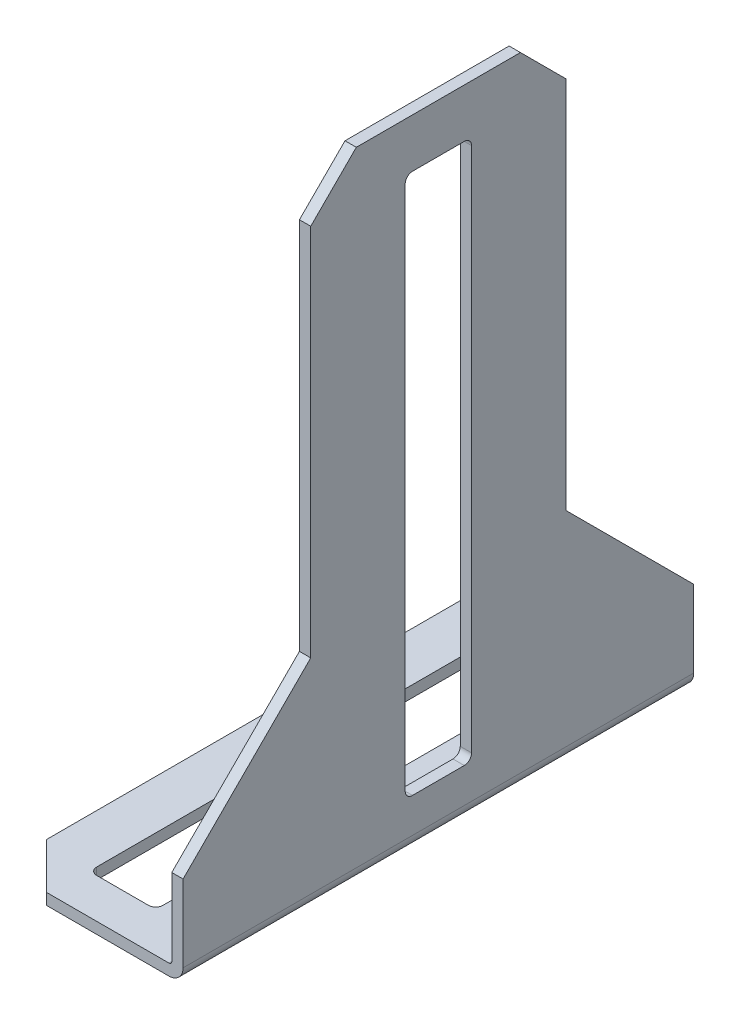
ISO-10303-21;
HEADER;
FILE_DESCRIPTION(('STEP AP214'),'2;1');
FILE_NAME('part.step','',(''),(''),'','','');
FILE_SCHEMA(('AUTOMOTIVE_DESIGN { 1 0 10303 214 1 1 1 1 }'));
ENDSEC;
DATA;
#1=APPLICATION_CONTEXT('core data for automotive mechanical design processes');
#2=APPLICATION_PROTOCOL_DEFINITION('international standard','automotive_design',2000,#1);
#3=PRODUCT_CONTEXT('',#1,'mechanical');
#4=PRODUCT('Part','Part','',(#3));
#5=PRODUCT_RELATED_PRODUCT_CATEGORY('part','',(#4));
#6=PRODUCT_DEFINITION_FORMATION('','',#4);
#7=PRODUCT_DEFINITION_CONTEXT('part definition',#1,'design');
#8=PRODUCT_DEFINITION('design','',#6,#7);
#9=PRODUCT_DEFINITION_SHAPE('','',#8);
#10=(LENGTH_UNIT() NAMED_UNIT(*) SI_UNIT(.MILLI.,.METRE.));
#11=(NAMED_UNIT(*) PLANE_ANGLE_UNIT() SI_UNIT($,.RADIAN.));
#12=(NAMED_UNIT(*) SI_UNIT($,.STERADIAN.) SOLID_ANGLE_UNIT());
#13=UNCERTAINTY_MEASURE_WITH_UNIT(LENGTH_MEASURE(1.E-05),#10,'distance_accuracy_value','');
#14=(GEOMETRIC_REPRESENTATION_CONTEXT(3) GLOBAL_UNCERTAINTY_ASSIGNED_CONTEXT((#13)) GLOBAL_UNIT_ASSIGNED_CONTEXT((#10,
#11,#12)) REPRESENTATION_CONTEXT('',''));
#15=CARTESIAN_POINT('',(0.,0.,0.));
#16=DIRECTION('',(0.,0.,1.));
#17=DIRECTION('',(1.,0.,0.));
#18=AXIS2_PLACEMENT_3D('',#15,#16,#17);
#19=CARTESIAN_POINT('',(3.9116,0.878660632863688,-14.5034));
#20=DIRECTION('',(0.,-1.,0.));
#21=DIRECTION('',(0.,0.,-1.));
#22=AXIS2_PLACEMENT_3D('',#19,#20,#21);
#23=CYLINDRICAL_SURFACE('',#22,0.508);
#24=CARTESIAN_POINT('',(3.9116,0.7874,-14.5034));
#25=DIRECTION('',(0.,-1.,0.));
#26=DIRECTION('',(0.,0.,-1.));
#27=AXIS2_PLACEMENT_3D('',#24,#25,#26);
#28=CIRCLE('',#27,0.508);
#29=CARTESIAN_POINT('',(3.4036,0.7874,-14.5034));
#30=VERTEX_POINT('',#29);
#31=CARTESIAN_POINT('',(3.9116,0.7874,-15.0114));
#32=VERTEX_POINT('',#31);
#33=EDGE_CURVE('E456',#30,#32,#28,.T.);
#34=ORIENTED_EDGE('',*,*,#33,.F.);
#35=DIRECTION('',(0.,1.,0.));
#36=VECTOR('',#35,1.);
#37=CARTESIAN_POINT('',(3.4036,0.7874,-14.5034));
#38=LINE('',#37,#36);
#39=CARTESIAN_POINT('',(3.4036,0.,-14.5034));
#40=VERTEX_POINT('',#39);
#41=EDGE_CURVE('E412',#30,#40,#38,.F.);
#42=ORIENTED_EDGE('',*,*,#41,.T.);
#43=CARTESIAN_POINT('',(3.9116,0.,-14.5034));
#44=DIRECTION('',(0.,-1.,0.));
#45=DIRECTION('',(0.,0.,-1.));
#46=AXIS2_PLACEMENT_3D('',#43,#44,#45);
#47=CIRCLE('',#46,0.508);
#48=CARTESIAN_POINT('',(3.9116,0.,-15.0114));
#49=VERTEX_POINT('',#48);
#50=EDGE_CURVE('E368',#49,#40,#47,.F.);
#51=ORIENTED_EDGE('',*,*,#50,.F.);
#52=DIRECTION('',(0.,1.,0.));
#53=VECTOR('',#52,1.);
#54=CARTESIAN_POINT('',(3.9116,0.7874,-15.0114));
#55=LINE('',#54,#53);
#56=EDGE_CURVE('E398',#49,#32,#55,.T.);
#57=ORIENTED_EDGE('',*,*,#56,.T.);
#58=EDGE_LOOP('',(#34,#42,#51,#57));
#59=FACE_BOUND('',#58,.T.);
#60=ADVANCED_FACE('F14',(#59),#23,.F.);
#61=CARTESIAN_POINT('',(3.4036,0.7874,-15.0114));
#62=DIRECTION('',(-1.,0.,0.));
#63=DIRECTION('',(0.,0.,1.));
#64=AXIS2_PLACEMENT_3D('',#61,#62,#63);
#65=PLANE('',#64);
#66=DIRECTION('',(0.,0.,-1.));
#67=VECTOR('',#66,1.);
#68=CARTESIAN_POINT('',(3.4036,0.,-17.78));
#69=LINE('',#68,#67);
#70=CARTESIAN_POINT('',(3.4036,0.,14.5034));
#71=VERTEX_POINT('',#70);
#72=EDGE_CURVE('E254',#40,#71,#69,.F.);
#73=ORIENTED_EDGE('',*,*,#72,.F.);
#74=ORIENTED_EDGE('',*,*,#41,.F.);
#75=DIRECTION('',(0.,0.,1.));
#76=VECTOR('',#75,1.);
#77=CARTESIAN_POINT('',(3.4036,0.7874,-17.78));
#78=LINE('',#77,#76);
#79=CARTESIAN_POINT('',(3.4036,0.7874,14.5034));
#80=VERTEX_POINT('',#79);
#81=EDGE_CURVE('E377',#80,#30,#78,.F.);
#82=ORIENTED_EDGE('',*,*,#81,.F.);
#83=DIRECTION('',(0.,-1.,0.));
#84=VECTOR('',#83,1.);
#85=CARTESIAN_POINT('',(3.4036,0.878660632863688,14.5034));
#86=LINE('',#85,#84);
#87=EDGE_CURVE('E410',#80,#71,#86,.T.);
#88=ORIENTED_EDGE('',*,*,#87,.T.);
#89=EDGE_LOOP('',(#73,#74,#82,#88));
#90=FACE_BOUND('',#89,.T.);
#91=ADVANCED_FACE('F605',(#90),#65,.F.);
#92=CARTESIAN_POINT('',(3.9116,0.878660632863688,14.5034));
#93=DIRECTION('',(0.,-1.,0.));
#94=DIRECTION('',(0.,0.,-1.));
#95=AXIS2_PLACEMENT_3D('',#92,#93,#94);
#96=CYLINDRICAL_SURFACE('',#95,0.508);
#97=CARTESIAN_POINT('',(3.9116,0.7874,14.5034));
#98=DIRECTION('',(0.,-1.,0.));
#99=DIRECTION('',(0.,0.,-1.));
#100=AXIS2_PLACEMENT_3D('',#97,#98,#99);
#101=CIRCLE('',#100,0.508);
#102=CARTESIAN_POINT('',(3.9116,0.7874,15.0114));
#103=VERTEX_POINT('',#102);
#104=EDGE_CURVE('E444',#103,#80,#101,.T.);
#105=ORIENTED_EDGE('',*,*,#104,.F.);
#106=DIRECTION('',(0.,1.,0.));
#107=VECTOR('',#106,1.);
#108=CARTESIAN_POINT('',(3.9116,0.7874,15.0114));
#109=LINE('',#108,#107);
#110=CARTESIAN_POINT('',(3.9116,0.,15.0114));
#111=VERTEX_POINT('',#110);
#112=EDGE_CURVE('E408',#103,#111,#109,.F.);
#113=ORIENTED_EDGE('',*,*,#112,.T.);
#114=CARTESIAN_POINT('',(3.9116,0.,14.5034));
#115=DIRECTION('',(0.,-1.,0.));
#116=DIRECTION('',(0.,0.,-1.));
#117=AXIS2_PLACEMENT_3D('',#114,#115,#116);
#118=CIRCLE('',#117,0.508);
#119=EDGE_CURVE('E439',#71,#111,#118,.F.);
#120=ORIENTED_EDGE('',*,*,#119,.F.);
#121=ORIENTED_EDGE('',*,*,#87,.F.);
#122=EDGE_LOOP('',(#105,#113,#120,#121));
#123=FACE_BOUND('',#122,.T.);
#124=ADVANCED_FACE('F601',(#123),#96,.F.);
#125=CARTESIAN_POINT('',(3.4036,0.7874,15.0114));
#126=DIRECTION('',(0.,0.,1.));
#127=DIRECTION('',(1.,0.,0.));
#128=AXIS2_PLACEMENT_3D('',#125,#126,#127);
#129=PLANE('',#128);
#130=DIRECTION('',(1.,0.,0.));
#131=VECTOR('',#130,1.);
#132=CARTESIAN_POINT('',(0.,0.,15.0114));
#133=LINE('',#132,#131);
#134=CARTESIAN_POINT('',(7.5184,0.,15.0114));
#135=VERTEX_POINT('',#134);
#136=EDGE_CURVE('E438',#111,#135,#133,.T.);
#137=ORIENTED_EDGE('',*,*,#136,.F.);
#138=ORIENTED_EDGE('',*,*,#112,.F.);
#139=DIRECTION('',(1.,0.,0.));
#140=VECTOR('',#139,1.);
#141=CARTESIAN_POINT('',(11.9126,0.7874,15.0114));
#142=LINE('',#141,#140);
#143=CARTESIAN_POINT('',(7.5184,0.7874,15.0114));
#144=VERTEX_POINT('',#143);
#145=EDGE_CURVE('E447',#144,#103,#142,.F.);
#146=ORIENTED_EDGE('',*,*,#145,.F.);
#147=DIRECTION('',(0.,-1.,0.));
#148=VECTOR('',#147,1.);
#149=CARTESIAN_POINT('',(7.5184,0.878660632863688,15.0114));
#150=LINE('',#149,#148);
#151=EDGE_CURVE('E406',#144,#135,#150,.T.);
#152=ORIENTED_EDGE('',*,*,#151,.T.);
#153=EDGE_LOOP('',(#137,#138,#146,#152));
#154=FACE_BOUND('',#153,.T.);
#155=ADVANCED_FACE('F597',(#154),#129,.F.);
#156=CARTESIAN_POINT('',(7.5184,0.878660632863688,14.5034));
#157=DIRECTION('',(0.,-1.,0.));
#158=DIRECTION('',(0.,0.,-1.));
#159=AXIS2_PLACEMENT_3D('',#156,#157,#158);
#160=CYLINDRICAL_SURFACE('',#159,0.508);
#161=CARTESIAN_POINT('',(7.5184,0.7874,14.5034));
#162=DIRECTION('',(0.,-1.,0.));
#163=DIRECTION('',(0.,0.,-1.));
#164=AXIS2_PLACEMENT_3D('',#161,#162,#163);
#165=CIRCLE('',#164,0.508);
#166=CARTESIAN_POINT('',(8.0264,0.7874,14.5034));
#167=VERTEX_POINT('',#166);
#168=EDGE_CURVE('E448',#167,#144,#165,.T.);
#169=ORIENTED_EDGE('',*,*,#168,.F.);
#170=DIRECTION('',(0.,1.,0.));
#171=VECTOR('',#170,1.);
#172=CARTESIAN_POINT('',(8.0264,0.7874,14.5034));
#173=LINE('',#172,#171);
#174=CARTESIAN_POINT('',(8.0264,0.,14.5034));
#175=VERTEX_POINT('',#174);
#176=EDGE_CURVE('E404',#167,#175,#173,.F.);
#177=ORIENTED_EDGE('',*,*,#176,.T.);
#178=CARTESIAN_POINT('',(7.5184,0.,14.5034));
#179=DIRECTION('',(0.,-1.,0.));
#180=DIRECTION('',(0.,0.,-1.));
#181=AXIS2_PLACEMENT_3D('',#178,#179,#180);
#182=CIRCLE('',#181,0.508);
#183=EDGE_CURVE('E435',#135,#175,#182,.F.);
#184=ORIENTED_EDGE('',*,*,#183,.F.);
#185=ORIENTED_EDGE('',*,*,#151,.F.);
#186=EDGE_LOOP('',(#169,#177,#184,#185));
#187=FACE_BOUND('',#186,.T.);
#188=ADVANCED_FACE('F593',(#187),#160,.F.);
#189=CARTESIAN_POINT('',(8.0264,0.7874,15.0114));
#190=DIRECTION('',(1.,0.,0.));
#191=DIRECTION('',(0.,0.,-1.));
#192=AXIS2_PLACEMENT_3D('',#189,#190,#191);
#193=PLANE('',#192);
#194=DIRECTION('',(0.,0.,1.));
#195=VECTOR('',#194,1.);
#196=CARTESIAN_POINT('',(8.0264,0.7874,-17.78));
#197=LINE('',#196,#195);
#198=CARTESIAN_POINT('',(8.0264,0.7874,-14.5034));
#199=VERTEX_POINT('',#198);
#200=EDGE_CURVE('E451',#199,#167,#197,.T.);
#201=ORIENTED_EDGE('',*,*,#200,.F.);
#202=DIRECTION('',(0.,-1.,0.));
#203=VECTOR('',#202,1.);
#204=CARTESIAN_POINT('',(8.0264,0.878660632863688,-14.5034));
#205=LINE('',#204,#203);
#206=CARTESIAN_POINT('',(8.0264,0.,-14.5034));
#207=VERTEX_POINT('',#206);
#208=EDGE_CURVE('E401',#199,#207,#205,.T.);
#209=ORIENTED_EDGE('',*,*,#208,.T.);
#210=DIRECTION('',(0.,0.,-1.));
#211=VECTOR('',#210,1.);
#212=CARTESIAN_POINT('',(8.0264,0.,-17.78));
#213=LINE('',#212,#211);
#214=EDGE_CURVE('E434',#175,#207,#213,.T.);
#215=ORIENTED_EDGE('',*,*,#214,.F.);
#216=ORIENTED_EDGE('',*,*,#176,.F.);
#217=EDGE_LOOP('',(#201,#209,#215,#216));
#218=FACE_BOUND('',#217,.T.);
#219=ADVANCED_FACE('F589',(#218),#193,.F.);
#220=CARTESIAN_POINT('',(7.5184,0.878660632863688,-14.5034));
#221=DIRECTION('',(0.,-1.,0.));
#222=DIRECTION('',(0.,0.,-1.));
#223=AXIS2_PLACEMENT_3D('',#220,#221,#222);
#224=CYLINDRICAL_SURFACE('',#223,0.508);
#225=CARTESIAN_POINT('',(7.5184,0.7874,-14.5034));
#226=DIRECTION('',(0.,-1.,0.));
#227=DIRECTION('',(0.,0.,-1.));
#228=AXIS2_PLACEMENT_3D('',#225,#226,#227);
#229=CIRCLE('',#228,0.508);
#230=CARTESIAN_POINT('',(7.5184,0.7874,-15.0114));
#231=VERTEX_POINT('',#230);
#232=EDGE_CURVE('E452',#231,#199,#229,.T.);
#233=ORIENTED_EDGE('',*,*,#232,.F.);
#234=DIRECTION('',(0.,1.,0.));
#235=VECTOR('',#234,1.);
#236=CARTESIAN_POINT('',(7.5184,0.7874,-15.0114));
#237=LINE('',#236,#235);
#238=CARTESIAN_POINT('',(7.5184,0.,-15.0114));
#239=VERTEX_POINT('',#238);
#240=EDGE_CURVE('E399',#231,#239,#237,.F.);
#241=ORIENTED_EDGE('',*,*,#240,.T.);
#242=CARTESIAN_POINT('',(7.5184,0.,-14.5034));
#243=DIRECTION('',(0.,-1.,0.));
#244=DIRECTION('',(0.,0.,-1.));
#245=AXIS2_PLACEMENT_3D('',#242,#243,#244);
#246=CIRCLE('',#245,0.508);
#247=EDGE_CURVE('E431',#207,#239,#246,.F.);
#248=ORIENTED_EDGE('',*,*,#247,.F.);
#249=ORIENTED_EDGE('',*,*,#208,.F.);
#250=EDGE_LOOP('',(#233,#241,#248,#249));
#251=FACE_BOUND('',#250,.T.);
#252=ADVANCED_FACE('F585',(#251),#224,.F.);
#253=CARTESIAN_POINT('',(8.0264,0.7874,-15.0114));
#254=DIRECTION('',(0.,0.,-1.));
#255=DIRECTION('',(-1.,0.,0.));
#256=AXIS2_PLACEMENT_3D('',#253,#254,#255);
#257=PLANE('',#256);
#258=DIRECTION('',(1.,0.,0.));
#259=VECTOR('',#258,1.);
#260=CARTESIAN_POINT('',(0.,0.,-15.0114));
#261=LINE('',#260,#259);
#262=EDGE_CURVE('E394',#239,#49,#261,.F.);
#263=ORIENTED_EDGE('',*,*,#262,.F.);
#264=ORIENTED_EDGE('',*,*,#240,.F.);
#265=DIRECTION('',(1.,0.,0.));
#266=VECTOR('',#265,1.);
#267=CARTESIAN_POINT('',(11.9126,0.7874,-15.0114));
#268=LINE('',#267,#266);
#269=EDGE_CURVE('E455',#32,#231,#268,.T.);
#270=ORIENTED_EDGE('',*,*,#269,.F.);
#271=ORIENTED_EDGE('',*,*,#56,.F.);
#272=EDGE_LOOP('',(#263,#264,#270,#271));
#273=FACE_BOUND('',#272,.T.);
#274=ADVANCED_FACE('F582',(#273),#257,.F.);
#275=CARTESIAN_POINT('',(0.,0.7874,-17.78));
#276=DIRECTION('',(-1.,0.,0.));
#277=DIRECTION('',(0.,0.,1.));
#278=AXIS2_PLACEMENT_3D('',#275,#276,#277);
#279=PLANE('',#278);
#280=DIRECTION('',(0.,0.,-1.));
#281=VECTOR('',#280,1.);
#282=CARTESIAN_POINT('',(0.,0.,-17.78));
#283=LINE('',#282,#281);
#284=CARTESIAN_POINT('',(0.,0.,14.605));
#285=VERTEX_POINT('',#284);
#286=CARTESIAN_POINT('',(0.,0.,-14.605));
#287=VERTEX_POINT('',#286);
#288=EDGE_CURVE('E373',#285,#287,#283,.T.);
#289=ORIENTED_EDGE('',*,*,#288,.F.);
#290=DIRECTION('',(0.,1.,0.));
#291=VECTOR('',#290,1.);
#292=CARTESIAN_POINT('',(0.,0.3937,14.605));
#293=LINE('',#292,#291);
#294=CARTESIAN_POINT('',(0.,0.7874,14.605));
#295=VERTEX_POINT('',#294);
#296=EDGE_CURVE('E388',#295,#285,#293,.F.);
#297=ORIENTED_EDGE('',*,*,#296,.F.);
#298=DIRECTION('',(0.,0.,1.));
#299=VECTOR('',#298,1.);
#300=CARTESIAN_POINT('',(0.,0.7874,-17.78));
#301=LINE('',#300,#299);
#302=CARTESIAN_POINT('',(0.,0.7874,-14.605));
#303=VERTEX_POINT('',#302);
#304=EDGE_CURVE('E369',#303,#295,#301,.T.);
#305=ORIENTED_EDGE('',*,*,#304,.F.);
#306=DIRECTION('',(0.,1.,0.));
#307=VECTOR('',#306,1.);
#308=CARTESIAN_POINT('',(0.,0.3937,-14.605));
#309=LINE('',#308,#307);
#310=EDGE_CURVE('E396',#287,#303,#309,.T.);
#311=ORIENTED_EDGE('',*,*,#310,.F.);
#312=EDGE_LOOP('',(#289,#297,#305,#311));
#313=FACE_BOUND('',#312,.T.);
#314=ADVANCED_FACE('F469',(#313),#279,.T.);
#315=CARTESIAN_POINT('',(1.5875,0.3937,-16.1925));
#316=DIRECTION('',(-0.707106781186548,0.,-0.707106781186548));
#317=DIRECTION('',(-0.707106781186548,0.,0.707106781186548));
#318=AXIS2_PLACEMENT_3D('',#315,#316,#317);
#319=PLANE('',#318);
#320=DIRECTION('',(0.,1.,0.));
#321=VECTOR('',#320,1.);
#322=CARTESIAN_POINT('',(3.175,0.3937,-17.78));
#323=LINE('',#322,#321);
#324=CARTESIAN_POINT('',(3.175,0.7874,-17.78));
#325=VERTEX_POINT('',#324);
#326=CARTESIAN_POINT('',(3.175,0.,-17.78));
#327=VERTEX_POINT('',#326);
#328=EDGE_CURVE('E391',#325,#327,#323,.F.);
#329=ORIENTED_EDGE('',*,*,#328,.T.);
#330=DIRECTION('',(0.707106781186547,0.,-0.707106781186548));
#331=VECTOR('',#330,1.);
#332=CARTESIAN_POINT('',(0.,0.,-14.605));
#333=LINE('',#332,#331);
#334=EDGE_CURVE('E362',#287,#327,#333,.T.);
#335=ORIENTED_EDGE('',*,*,#334,.F.);
#336=ORIENTED_EDGE('',*,*,#310,.T.);
#337=DIRECTION('',(-0.707106781186547,0.,0.707106781186548));
#338=VECTOR('',#337,1.);
#339=CARTESIAN_POINT('',(3.175,0.7874,-17.78));
#340=LINE('',#339,#338);
#341=EDGE_CURVE('E374',#325,#303,#340,.T.);
#342=ORIENTED_EDGE('',*,*,#341,.F.);
#343=EDGE_LOOP('',(#329,#335,#336,#342));
#344=FACE_BOUND('',#343,.T.);
#345=ADVANCED_FACE('F473',(#344),#319,.T.);
#346=CARTESIAN_POINT('',(1.5875,0.3937,16.1925));
#347=DIRECTION('',(-0.707106781186548,0.,0.707106781186548));
#348=DIRECTION('',(0.707106781186548,0.,0.707106781186548));
#349=AXIS2_PLACEMENT_3D('',#346,#347,#348);
#350=PLANE('',#349);
#351=DIRECTION('',(0.,1.,0.));
#352=VECTOR('',#351,1.);
#353=CARTESIAN_POINT('',(3.175,0.3937,17.78));
#354=LINE('',#353,#352);
#355=CARTESIAN_POINT('',(3.175,0.,17.78));
#356=VERTEX_POINT('',#355);
#357=CARTESIAN_POINT('',(3.175,0.7874,17.78));
#358=VERTEX_POINT('',#357);
#359=EDGE_CURVE('E233',#356,#358,#354,.T.);
#360=ORIENTED_EDGE('',*,*,#359,.T.);
#361=DIRECTION('',(0.707106781186549,0.,0.707106781186546));
#362=VECTOR('',#361,1.);
#363=CARTESIAN_POINT('',(0.,0.7874,14.605));
#364=LINE('',#363,#362);
#365=EDGE_CURVE('E365',#295,#358,#364,.T.);
#366=ORIENTED_EDGE('',*,*,#365,.F.);
#367=ORIENTED_EDGE('',*,*,#296,.T.);
#368=DIRECTION('',(-0.707106781186548,0.,-0.707106781186547));
#369=VECTOR('',#368,1.);
#370=CARTESIAN_POINT('',(3.175,0.,17.78));
#371=LINE('',#370,#369);
#372=EDGE_CURVE('E241',#356,#285,#371,.T.);
#373=ORIENTED_EDGE('',*,*,#372,.F.);
#374=EDGE_LOOP('',(#360,#366,#367,#373));
#375=FACE_BOUND('',#374,.T.);
#376=ADVANCED_FACE('F466',(#375),#350,.T.);
#377=CARTESIAN_POINT('',(11.7094,0.9906,17.8712606328632));
#378=DIRECTION('',(0.,0.,-1.));
#379=DIRECTION('',(-1.,0.,0.));
#380=AXIS2_PLACEMENT_3D('',#377,#378,#379);
#381=CYLINDRICAL_SURFACE('',#380,0.990599999999999);
#382=DIRECTION('',(0.,0.,-1.));
#383=VECTOR('',#382,1.);
#384=CARTESIAN_POINT('',(12.7,0.9906,-17.78));
#385=LINE('',#384,#383);
#386=CARTESIAN_POINT('',(12.7,0.9906,17.78));
#387=VERTEX_POINT('',#386);
#388=CARTESIAN_POINT('',(12.7,0.9906,-17.78));
#389=VERTEX_POINT('',#388);
#390=EDGE_CURVE('E227',#387,#389,#385,.T.);
#391=ORIENTED_EDGE('',*,*,#390,.F.);
#392=CARTESIAN_POINT('',(11.7094,0.9906,17.78));
#393=DIRECTION('',(0.,0.,-1.));
#394=DIRECTION('',(-1.,0.,0.));
#395=AXIS2_PLACEMENT_3D('',#392,#393,#394);
#396=CIRCLE('',#395,0.990599999999999);
#397=CARTESIAN_POINT('',(11.7094,0.,17.78));
#398=VERTEX_POINT('',#397);
#399=EDGE_CURVE('E232',#387,#398,#396,.T.);
#400=ORIENTED_EDGE('',*,*,#399,.T.);
#401=DIRECTION('',(0.,0.,-1.));
#402=VECTOR('',#401,1.);
#403=CARTESIAN_POINT('',(11.7094,0.,-17.78));
#404=LINE('',#403,#402);
#405=CARTESIAN_POINT('',(11.7094,0.,-17.78));
#406=VERTEX_POINT('',#405);
#407=EDGE_CURVE('E230',#406,#398,#404,.F.);
#408=ORIENTED_EDGE('',*,*,#407,.F.);
#409=CARTESIAN_POINT('',(11.7094,0.9906,-17.78));
#410=DIRECTION('',(0.,0.,-1.));
#411=DIRECTION('',(-1.,0.,0.));
#412=AXIS2_PLACEMENT_3D('',#409,#410,#411);
#413=CIRCLE('',#412,0.990599999999999);
#414=EDGE_CURVE('E18',#406,#389,#413,.F.);
#415=ORIENTED_EDGE('',*,*,#414,.T.);
#416=EDGE_LOOP('',(#391,#400,#408,#415));
#417=FACE_BOUND('',#416,.T.);
#418=ADVANCED_FACE('F226',(#417),#381,.T.);
#419=CARTESIAN_POINT('',(11.9126,0.7874,-17.78));
#420=DIRECTION('',(0.,1.,0.));
#421=DIRECTION('',(0.,0.,1.));
#422=AXIS2_PLACEMENT_3D('',#419,#420,#421);
#423=PLANE('',#422);
#424=DIRECTION('',(1.,0.,0.));
#425=VECTOR('',#424,1.);
#426=CARTESIAN_POINT('',(0.,0.7874,17.78));
#427=LINE('',#426,#425);
#428=CARTESIAN_POINT('',(11.7094,0.7874,17.78));
#429=VERTEX_POINT('',#428);
#430=EDGE_CURVE('E265',#429,#358,#427,.F.);
#431=ORIENTED_EDGE('',*,*,#430,.F.);
#432=DIRECTION('',(0.,0.,1.));
#433=VECTOR('',#432,1.);
#434=CARTESIAN_POINT('',(11.7094,0.787399999999999,-17.8579774517918));
#435=LINE('',#434,#433);
#436=CARTESIAN_POINT('',(11.7094,0.7874,-17.78));
#437=VERTEX_POINT('',#436);
#438=EDGE_CURVE('E249',#429,#437,#435,.F.);
#439=ORIENTED_EDGE('',*,*,#438,.T.);
#440=DIRECTION('',(1.,0.,0.));
#441=VECTOR('',#440,1.);
#442=CARTESIAN_POINT('',(0.,0.7874,-17.78));
#443=LINE('',#442,#441);
#444=EDGE_CURVE('E251',#437,#325,#443,.F.);
#445=ORIENTED_EDGE('',*,*,#444,.T.);
#446=ORIENTED_EDGE('',*,*,#341,.T.);
#447=ORIENTED_EDGE('',*,*,#304,.T.);
#448=ORIENTED_EDGE('',*,*,#365,.T.);
#449=EDGE_LOOP('',(#431,#439,#445,#446,#447,#448));
#450=FACE_BOUND('',#449,.T.);
#451=ORIENTED_EDGE('',*,*,#104,.T.);
#452=ORIENTED_EDGE('',*,*,#81,.T.);
#453=ORIENTED_EDGE('',*,*,#33,.T.);
#454=ORIENTED_EDGE('',*,*,#269,.T.);
#455=ORIENTED_EDGE('',*,*,#232,.T.);
#456=ORIENTED_EDGE('',*,*,#200,.T.);
#457=ORIENTED_EDGE('',*,*,#168,.T.);
#458=ORIENTED_EDGE('',*,*,#145,.T.);
#459=EDGE_LOOP('',(#451,#452,#453,#454,#455,#456,#457,#458));
#460=FACE_BOUND('',#459,.T.);
#461=ADVANCED_FACE('F571',(#450,#460),#423,.T.);
#462=CARTESIAN_POINT('',(0.,0.,-17.78));
#463=DIRECTION('',(0.,-1.,0.));
#464=DIRECTION('',(0.,0.,-1.));
#465=AXIS2_PLACEMENT_3D('',#462,#463,#464);
#466=PLANE('',#465);
#467=DIRECTION('',(1.,0.,0.));
#468=VECTOR('',#467,1.);
#469=CARTESIAN_POINT('',(0.,0.,17.78));
#470=LINE('',#469,#468);
#471=EDGE_CURVE('E262',#356,#398,#470,.T.);
#472=ORIENTED_EDGE('',*,*,#471,.F.);
#473=ORIENTED_EDGE('',*,*,#372,.T.);
#474=ORIENTED_EDGE('',*,*,#288,.T.);
#475=ORIENTED_EDGE('',*,*,#334,.T.);
#476=DIRECTION('',(1.,0.,0.));
#477=VECTOR('',#476,1.);
#478=CARTESIAN_POINT('',(0.,0.,-17.78));
#479=LINE('',#478,#477);
#480=EDGE_CURVE('E247',#327,#406,#479,.T.);
#481=ORIENTED_EDGE('',*,*,#480,.T.);
#482=ORIENTED_EDGE('',*,*,#407,.T.);
#483=EDGE_LOOP('',(#472,#473,#474,#475,#481,#482));
#484=FACE_BOUND('',#483,.T.);
#485=ORIENTED_EDGE('',*,*,#247,.T.);
#486=ORIENTED_EDGE('',*,*,#262,.T.);
#487=ORIENTED_EDGE('',*,*,#50,.T.);
#488=ORIENTED_EDGE('',*,*,#72,.T.);
#489=ORIENTED_EDGE('',*,*,#119,.T.);
#490=ORIENTED_EDGE('',*,*,#136,.T.);
#491=ORIENTED_EDGE('',*,*,#183,.T.);
#492=ORIENTED_EDGE('',*,*,#214,.T.);
#493=EDGE_LOOP('',(#485,#486,#487,#488,#489,#490,#491,#492));
#494=FACE_BOUND('',#493,.T.);
#495=ADVANCED_FACE('F460',(#484,#494),#466,.T.);
#496=CARTESIAN_POINT('',(12.7,0.,-17.78));
#497=DIRECTION('',(1.,0.,0.));
#498=DIRECTION('',(0.,0.,-1.));
#499=AXIS2_PLACEMENT_3D('',#496,#497,#498);
#500=PLANE('',#499);
#501=DIRECTION('',(0.,1.,0.));
#502=VECTOR('',#501,1.);
#503=CARTESIAN_POINT('',(12.7,44.45,-8.89));
#504=LINE('',#503,#502);
#505=CARTESIAN_POINT('',(12.7,15.24,-8.89));
#506=VERTEX_POINT('',#505);
#507=CARTESIAN_POINT('',(12.7,41.275,-8.89));
#508=VERTEX_POINT('',#507);
#509=EDGE_CURVE('E308',#506,#508,#504,.T.);
#510=ORIENTED_EDGE('',*,*,#509,.T.);
#511=DIRECTION('',(0.,0.707106781186548,0.707106781186548));
#512=VECTOR('',#511,1.);
#513=CARTESIAN_POINT('',(12.7,42.8625,-7.3025));
#514=LINE('',#513,#512);
#515=CARTESIAN_POINT('',(12.7,44.45,-5.715));
#516=VERTEX_POINT('',#515);
#517=EDGE_CURVE('E315',#516,#508,#514,.F.);
#518=ORIENTED_EDGE('',*,*,#517,.F.);
#519=DIRECTION('',(0.,0.,1.));
#520=VECTOR('',#519,1.);
#521=CARTESIAN_POINT('',(12.7,44.45,-17.78));
#522=LINE('',#521,#520);
#523=CARTESIAN_POINT('',(12.7,44.45,5.715));
#524=VERTEX_POINT('',#523);
#525=EDGE_CURVE('E316',#524,#516,#522,.F.);
#526=ORIENTED_EDGE('',*,*,#525,.F.);
#527=DIRECTION('',(0.,-0.707106781186548,0.707106781186548));
#528=VECTOR('',#527,1.);
#529=CARTESIAN_POINT('',(12.7,42.8625,7.3025));
#530=LINE('',#529,#528);
#531=CARTESIAN_POINT('',(12.7,41.275,8.89));
#532=VERTEX_POINT('',#531);
#533=EDGE_CURVE('E323',#532,#524,#530,.F.);
#534=ORIENTED_EDGE('',*,*,#533,.F.);
#535=DIRECTION('',(0.,1.,0.));
#536=VECTOR('',#535,1.);
#537=CARTESIAN_POINT('',(12.7,15.24,8.89));
#538=LINE('',#537,#536);
#539=CARTESIAN_POINT('',(12.7,15.24,8.89));
#540=VERTEX_POINT('',#539);
#541=EDGE_CURVE('E329',#532,#540,#538,.F.);
#542=ORIENTED_EDGE('',*,*,#541,.T.);
#543=DIRECTION('',(0.,0.707106781186548,-0.707106781186548));
#544=VECTOR('',#543,1.);
#545=CARTESIAN_POINT('',(12.7,6.35,17.78));
#546=LINE('',#545,#544);
#547=CARTESIAN_POINT('',(12.7,6.35,17.78));
#548=VERTEX_POINT('',#547);
#549=EDGE_CURVE('E294',#540,#548,#546,.F.);
#550=ORIENTED_EDGE('',*,*,#549,.T.);
#551=DIRECTION('',(0.,1.,0.));
#552=VECTOR('',#551,1.);
#553=CARTESIAN_POINT('',(12.7,0.,17.78));
#554=LINE('',#553,#552);
#555=EDGE_CURVE('E239',#387,#548,#554,.T.);
#556=ORIENTED_EDGE('',*,*,#555,.F.);
#557=ORIENTED_EDGE('',*,*,#390,.T.);
#558=DIRECTION('',(0.,1.,0.));
#559=VECTOR('',#558,1.);
#560=CARTESIAN_POINT('',(12.7,0.,-17.78));
#561=LINE('',#560,#559);
#562=CARTESIAN_POINT('',(12.7,6.35,-17.78));
#563=VERTEX_POINT('',#562);
#564=EDGE_CURVE('E237',#389,#563,#561,.T.);
#565=ORIENTED_EDGE('',*,*,#564,.T.);
#566=DIRECTION('',(0.,-0.707106781186548,-0.707106781186548));
#567=VECTOR('',#566,1.);
#568=CARTESIAN_POINT('',(12.7,15.24,-8.89));
#569=LINE('',#568,#567);
#570=EDGE_CURVE('E302',#563,#506,#569,.F.);
#571=ORIENTED_EDGE('',*,*,#570,.T.);
#572=EDGE_LOOP('',(#510,#518,#526,#534,#542,#550,#556,#557,#565,#571));
#573=FACE_BOUND('',#572,.T.);
#574=CARTESIAN_POINT('',(12.7,40.5384,-1.8034));
#575=DIRECTION('',(1.,0.,0.));
#576=DIRECTION('',(0.,0.,-1.));
#577=AXIS2_PLACEMENT_3D('',#574,#575,#576);
#578=CIRCLE('',#577,0.508);
#579=CARTESIAN_POINT('',(12.7,41.0464,-1.8034));
#580=VERTEX_POINT('',#579);
#581=CARTESIAN_POINT('',(12.7,40.5384,-2.3114));
#582=VERTEX_POINT('',#581);
#583=EDGE_CURVE('E354',#580,#582,#578,.F.);
#584=ORIENTED_EDGE('',*,*,#583,.T.);
#585=DIRECTION('',(0.,1.,0.));
#586=VECTOR('',#585,1.);
#587=CARTESIAN_POINT('',(12.7,41.0464,-2.3114));
#588=LINE('',#587,#586);
#589=CARTESIAN_POINT('',(12.7,3.9116,-2.3114));
#590=VERTEX_POINT('',#589);
#591=EDGE_CURVE('E357',#582,#590,#588,.F.);
#592=ORIENTED_EDGE('',*,*,#591,.T.);
#593=CARTESIAN_POINT('',(12.7,3.9116,-1.8034));
#594=DIRECTION('',(1.,0.,0.));
#595=DIRECTION('',(0.,0.,-1.));
#596=AXIS2_PLACEMENT_3D('',#593,#594,#595);
#597=CIRCLE('',#596,0.508);
#598=CARTESIAN_POINT('',(12.7,3.4036,-1.8034));
#599=VERTEX_POINT('',#598);
#600=EDGE_CURVE('E240',#590,#599,#597,.F.);
#601=ORIENTED_EDGE('',*,*,#600,.T.);
#602=DIRECTION('',(0.,0.,-1.));
#603=VECTOR('',#602,1.);
#604=CARTESIAN_POINT('',(12.7,3.4036,-2.3114));
#605=LINE('',#604,#603);
#606=CARTESIAN_POINT('',(12.7,3.4036,1.8034));
#607=VERTEX_POINT('',#606);
#608=EDGE_CURVE('E336',#599,#607,#605,.F.);
#609=ORIENTED_EDGE('',*,*,#608,.T.);
#610=CARTESIAN_POINT('',(12.7,3.9116,1.8034));
#611=DIRECTION('',(1.,0.,0.));
#612=DIRECTION('',(0.,0.,-1.));
#613=AXIS2_PLACEMENT_3D('',#610,#611,#612);
#614=CIRCLE('',#613,0.508);
#615=CARTESIAN_POINT('',(12.7,3.9116,2.3114));
#616=VERTEX_POINT('',#615);
#617=EDGE_CURVE('E342',#607,#616,#614,.F.);
#618=ORIENTED_EDGE('',*,*,#617,.T.);
#619=DIRECTION('',(0.,1.,0.));
#620=VECTOR('',#619,1.);
#621=CARTESIAN_POINT('',(12.7,3.4036,2.3114));
#622=LINE('',#621,#620);
#623=CARTESIAN_POINT('',(12.7,40.5384,2.3114));
#624=VERTEX_POINT('',#623);
#625=EDGE_CURVE('E345',#616,#624,#622,.T.);
#626=ORIENTED_EDGE('',*,*,#625,.T.);
#627=CARTESIAN_POINT('',(12.7,40.5384,1.8034));
#628=DIRECTION('',(1.,0.,0.));
#629=DIRECTION('',(0.,0.,-1.));
#630=AXIS2_PLACEMENT_3D('',#627,#628,#629);
#631=CIRCLE('',#630,0.508);
#632=CARTESIAN_POINT('',(12.7,41.0464,1.8034));
#633=VERTEX_POINT('',#632);
#634=EDGE_CURVE('E348',#624,#633,#631,.F.);
#635=ORIENTED_EDGE('',*,*,#634,.T.);
#636=DIRECTION('',(0.,0.,1.));
#637=VECTOR('',#636,1.);
#638=CARTESIAN_POINT('',(12.7,41.0464,2.3114));
#639=LINE('',#638,#637);
#640=EDGE_CURVE('E351',#633,#580,#639,.F.);
#641=ORIENTED_EDGE('',*,*,#640,.T.);
#642=EDGE_LOOP('',(#584,#592,#601,#609,#618,#626,#635,#641));
#643=FACE_BOUND('',#642,.T.);
#644=ADVANCED_FACE('F235',(#573,#643),#500,.T.);
#645=CARTESIAN_POINT('',(11.8213393671368,3.9116,-1.8034));
#646=DIRECTION('',(1.,0.,0.));
#647=DIRECTION('',(0.,0.,-1.));
#648=AXIS2_PLACEMENT_3D('',#645,#646,#647);
#649=CYLINDRICAL_SURFACE('',#648,0.508);
#650=CARTESIAN_POINT('',(11.9126,3.9116,-1.8034));
#651=DIRECTION('',(1.,0.,0.));
#652=DIRECTION('',(0.,0.,-1.));
#653=AXIS2_PLACEMENT_3D('',#650,#651,#652);
#654=CIRCLE('',#653,0.508);
#655=CARTESIAN_POINT('',(11.9126,3.4036,-1.8034));
#656=VERTEX_POINT('',#655);
#657=CARTESIAN_POINT('',(11.9126,3.9116,-2.3114));
#658=VERTEX_POINT('',#657);
#659=EDGE_CURVE('E285',#656,#658,#654,.T.);
#660=ORIENTED_EDGE('',*,*,#659,.F.);
#661=DIRECTION('',(1.,0.,0.));
#662=VECTOR('',#661,1.);
#663=CARTESIAN_POINT('',(11.9126,3.4036,-1.8034));
#664=LINE('',#663,#662);
#665=EDGE_CURVE('E337',#656,#599,#664,.T.);
#666=ORIENTED_EDGE('',*,*,#665,.T.);
#667=ORIENTED_EDGE('',*,*,#600,.F.);
#668=DIRECTION('',(-1.,0.,0.));
#669=VECTOR('',#668,1.);
#670=CARTESIAN_POINT('',(11.9126,3.9116,-2.3114));
#671=LINE('',#670,#669);
#672=EDGE_CURVE('E355',#590,#658,#671,.T.);
#673=ORIENTED_EDGE('',*,*,#672,.T.);
#674=EDGE_LOOP('',(#660,#666,#667,#673));
#675=FACE_BOUND('',#674,.T.);
#676=ADVANCED_FACE('F562',(#675),#649,.F.);
#677=CARTESIAN_POINT('',(11.9126,41.0464,-2.3114));
#678=DIRECTION('',(0.,0.,-1.));
#679=DIRECTION('',(-1.,0.,0.));
#680=AXIS2_PLACEMENT_3D('',#677,#678,#679);
#681=PLANE('',#680);
#682=ORIENTED_EDGE('',*,*,#591,.F.);
#683=DIRECTION('',(1.,0.,0.));
#684=VECTOR('',#683,1.);
#685=CARTESIAN_POINT('',(11.8213393671368,40.5384,-2.3114));
#686=LINE('',#685,#684);
#687=CARTESIAN_POINT('',(11.9126,40.5384,-2.3114));
#688=VERTEX_POINT('',#687);
#689=EDGE_CURVE('E352',#582,#688,#686,.F.);
#690=ORIENTED_EDGE('',*,*,#689,.T.);
#691=DIRECTION('',(0.,1.,0.));
#692=VECTOR('',#691,1.);
#693=CARTESIAN_POINT('',(11.9126,44.45,-2.3114));
#694=LINE('',#693,#692);
#695=EDGE_CURVE('E282',#658,#688,#694,.T.);
#696=ORIENTED_EDGE('',*,*,#695,.F.);
#697=ORIENTED_EDGE('',*,*,#672,.F.);
#698=EDGE_LOOP('',(#682,#690,#696,#697));
#699=FACE_BOUND('',#698,.T.);
#700=ADVANCED_FACE('F558',(#699),#681,.F.);
#701=CARTESIAN_POINT('',(11.8213393671368,40.5384,-1.8034));
#702=DIRECTION('',(1.,0.,0.));
#703=DIRECTION('',(0.,0.,-1.));
#704=AXIS2_PLACEMENT_3D('',#701,#702,#703);
#705=CYLINDRICAL_SURFACE('',#704,0.508);
#706=CARTESIAN_POINT('',(11.9126,40.5384,-1.8034));
#707=DIRECTION('',(1.,0.,0.));
#708=DIRECTION('',(0.,0.,-1.));
#709=AXIS2_PLACEMENT_3D('',#706,#707,#708);
#710=CIRCLE('',#709,0.508);
#711=CARTESIAN_POINT('',(11.9126,41.0464,-1.8034));
#712=VERTEX_POINT('',#711);
#713=EDGE_CURVE('E281',#688,#712,#710,.T.);
#714=ORIENTED_EDGE('',*,*,#713,.F.);
#715=ORIENTED_EDGE('',*,*,#689,.F.);
#716=ORIENTED_EDGE('',*,*,#583,.F.);
#717=DIRECTION('',(1.,0.,0.));
#718=VECTOR('',#717,1.);
#719=CARTESIAN_POINT('',(11.9126,41.0464,-1.8034));
#720=LINE('',#719,#718);
#721=EDGE_CURVE('E349',#580,#712,#720,.F.);
#722=ORIENTED_EDGE('',*,*,#721,.T.);
#723=EDGE_LOOP('',(#714,#715,#716,#722));
#724=FACE_BOUND('',#723,.T.);
#725=ADVANCED_FACE('F554',(#724),#705,.F.);
#726=CARTESIAN_POINT('',(11.9126,41.0464,2.3114));
#727=DIRECTION('',(0.,1.,0.));
#728=DIRECTION('',(0.,0.,1.));
#729=AXIS2_PLACEMENT_3D('',#726,#727,#728);
#730=PLANE('',#729);
#731=DIRECTION('',(0.,0.,1.));
#732=VECTOR('',#731,1.);
#733=CARTESIAN_POINT('',(11.9126,41.0464,-17.78));
#734=LINE('',#733,#732);
#735=CARTESIAN_POINT('',(11.9126,41.0464,1.8034));
#736=VERTEX_POINT('',#735);
#737=EDGE_CURVE('E278',#712,#736,#734,.T.);
#738=ORIENTED_EDGE('',*,*,#737,.F.);
#739=ORIENTED_EDGE('',*,*,#721,.F.);
#740=ORIENTED_EDGE('',*,*,#640,.F.);
#741=DIRECTION('',(1.,0.,0.));
#742=VECTOR('',#741,1.);
#743=CARTESIAN_POINT('',(11.8213393671368,41.0464,1.8034));
#744=LINE('',#743,#742);
#745=EDGE_CURVE('E346',#633,#736,#744,.F.);
#746=ORIENTED_EDGE('',*,*,#745,.T.);
#747=EDGE_LOOP('',(#738,#739,#740,#746));
#748=FACE_BOUND('',#747,.T.);
#749=ADVANCED_FACE('F550',(#748),#730,.F.);
#750=CARTESIAN_POINT('',(11.8213393671368,40.5384,1.8034));
#751=DIRECTION('',(1.,0.,0.));
#752=DIRECTION('',(0.,0.,-1.));
#753=AXIS2_PLACEMENT_3D('',#750,#751,#752);
#754=CYLINDRICAL_SURFACE('',#753,0.508);
#755=CARTESIAN_POINT('',(11.9126,40.5384,1.8034));
#756=DIRECTION('',(1.,0.,0.));
#757=DIRECTION('',(0.,0.,-1.));
#758=AXIS2_PLACEMENT_3D('',#755,#756,#757);
#759=CIRCLE('',#758,0.508);
#760=CARTESIAN_POINT('',(11.9126,40.5384,2.3114));
#761=VERTEX_POINT('',#760);
#762=EDGE_CURVE('E277',#736,#761,#759,.T.);
#763=ORIENTED_EDGE('',*,*,#762,.F.);
#764=ORIENTED_EDGE('',*,*,#745,.F.);
#765=ORIENTED_EDGE('',*,*,#634,.F.);
#766=DIRECTION('',(1.,0.,0.));
#767=VECTOR('',#766,1.);
#768=CARTESIAN_POINT('',(11.9126,40.5384,2.3114));
#769=LINE('',#768,#767);
#770=EDGE_CURVE('E343',#624,#761,#769,.F.);
#771=ORIENTED_EDGE('',*,*,#770,.T.);
#772=EDGE_LOOP('',(#763,#764,#765,#771));
#773=FACE_BOUND('',#772,.T.);
#774=ADVANCED_FACE('F546',(#773),#754,.F.);
#775=CARTESIAN_POINT('',(11.9126,3.4036,2.3114));
#776=DIRECTION('',(0.,0.,1.));
#777=DIRECTION('',(1.,0.,0.));
#778=AXIS2_PLACEMENT_3D('',#775,#776,#777);
#779=PLANE('',#778);
#780=ORIENTED_EDGE('',*,*,#625,.F.);
#781=DIRECTION('',(1.,0.,0.));
#782=VECTOR('',#781,1.);
#783=CARTESIAN_POINT('',(11.8213393671368,3.9116,2.3114));
#784=LINE('',#783,#782);
#785=CARTESIAN_POINT('',(11.9126,3.9116,2.3114));
#786=VERTEX_POINT('',#785);
#787=EDGE_CURVE('E340',#616,#786,#784,.F.);
#788=ORIENTED_EDGE('',*,*,#787,.T.);
#789=DIRECTION('',(0.,1.,0.));
#790=VECTOR('',#789,1.);
#791=CARTESIAN_POINT('',(11.9126,44.45,2.3114));
#792=LINE('',#791,#790);
#793=EDGE_CURVE('E274',#761,#786,#792,.F.);
#794=ORIENTED_EDGE('',*,*,#793,.F.);
#795=ORIENTED_EDGE('',*,*,#770,.F.);
#796=EDGE_LOOP('',(#780,#788,#794,#795));
#797=FACE_BOUND('',#796,.T.);
#798=ADVANCED_FACE('F542',(#797),#779,.F.);
#799=CARTESIAN_POINT('',(11.8213393671368,3.9116,1.8034));
#800=DIRECTION('',(1.,0.,0.));
#801=DIRECTION('',(0.,0.,-1.));
#802=AXIS2_PLACEMENT_3D('',#799,#800,#801);
#803=CYLINDRICAL_SURFACE('',#802,0.508);
#804=CARTESIAN_POINT('',(11.9126,3.9116,1.8034));
#805=DIRECTION('',(1.,0.,0.));
#806=DIRECTION('',(0.,0.,-1.));
#807=AXIS2_PLACEMENT_3D('',#804,#805,#806);
#808=CIRCLE('',#807,0.508);
#809=CARTESIAN_POINT('',(11.9126,3.4036,1.8034));
#810=VERTEX_POINT('',#809);
#811=EDGE_CURVE('E273',#786,#810,#808,.T.);
#812=ORIENTED_EDGE('',*,*,#811,.F.);
#813=ORIENTED_EDGE('',*,*,#787,.F.);
#814=ORIENTED_EDGE('',*,*,#617,.F.);
#815=DIRECTION('',(1.,0.,0.));
#816=VECTOR('',#815,1.);
#817=CARTESIAN_POINT('',(11.9126,3.4036,1.8034));
#818=LINE('',#817,#816);
#819=EDGE_CURVE('E334',#607,#810,#818,.F.);
#820=ORIENTED_EDGE('',*,*,#819,.T.);
#821=EDGE_LOOP('',(#812,#813,#814,#820));
#822=FACE_BOUND('',#821,.T.);
#823=ADVANCED_FACE('F538',(#822),#803,.F.);
#824=CARTESIAN_POINT('',(11.9126,3.4036,-2.3114));
#825=DIRECTION('',(0.,-1.,0.));
#826=DIRECTION('',(0.,0.,-1.));
#827=AXIS2_PLACEMENT_3D('',#824,#825,#826);
#828=PLANE('',#827);
#829=ORIENTED_EDGE('',*,*,#608,.F.);
#830=ORIENTED_EDGE('',*,*,#665,.F.);
#831=DIRECTION('',(0.,0.,1.));
#832=VECTOR('',#831,1.);
#833=CARTESIAN_POINT('',(11.9126,3.4036,-17.78));
#834=LINE('',#833,#832);
#835=EDGE_CURVE('E269',#810,#656,#834,.F.);
#836=ORIENTED_EDGE('',*,*,#835,.F.);
#837=ORIENTED_EDGE('',*,*,#819,.F.);
#838=EDGE_LOOP('',(#829,#830,#836,#837));
#839=FACE_BOUND('',#838,.T.);
#840=ADVANCED_FACE('F535',(#839),#828,.F.);
#841=CARTESIAN_POINT('',(12.7,15.24,8.89));
#842=DIRECTION('',(0.,0.,-1.));
#843=DIRECTION('',(-1.,0.,0.));
#844=AXIS2_PLACEMENT_3D('',#841,#842,#843);
#845=PLANE('',#844);
#846=ORIENTED_EDGE('',*,*,#541,.F.);
#847=DIRECTION('',(1.,0.,0.));
#848=VECTOR('',#847,1.);
#849=CARTESIAN_POINT('',(12.3063,41.275,8.89));
#850=LINE('',#849,#848);
#851=CARTESIAN_POINT('',(11.9126,41.275,8.89));
#852=VERTEX_POINT('',#851);
#853=EDGE_CURVE('E326',#852,#532,#850,.T.);
#854=ORIENTED_EDGE('',*,*,#853,.F.);
#855=DIRECTION('',(0.,1.,0.));
#856=VECTOR('',#855,1.);
#857=CARTESIAN_POINT('',(11.9126,44.45,8.89));
#858=LINE('',#857,#856);
#859=CARTESIAN_POINT('',(11.9126,15.24,8.89));
#860=VERTEX_POINT('',#859);
#861=EDGE_CURVE('E272',#860,#852,#858,.T.);
#862=ORIENTED_EDGE('',*,*,#861,.F.);
#863=DIRECTION('',(1.,0.,0.));
#864=VECTOR('',#863,1.);
#865=CARTESIAN_POINT('',(12.7,15.24,8.89));
#866=LINE('',#865,#864);
#867=EDGE_CURVE('E293',#860,#540,#866,.T.);
#868=ORIENTED_EDGE('',*,*,#867,.T.);
#869=EDGE_LOOP('',(#846,#854,#862,#868));
#870=FACE_BOUND('',#869,.T.);
#871=ADVANCED_FACE('F506',(#870),#845,.F.);
#872=CARTESIAN_POINT('',(12.3063,42.8625,7.3025));
#873=DIRECTION('',(0.,0.707106781186548,0.707106781186548));
#874=DIRECTION('',(0.,-0.707106781186548,0.707106781186548));
#875=AXIS2_PLACEMENT_3D('',#872,#873,#874);
#876=PLANE('',#875);
#877=DIRECTION('',(1.,0.,0.));
#878=VECTOR('',#877,1.);
#879=CARTESIAN_POINT('',(12.7,44.45,5.715));
#880=LINE('',#879,#878);
#881=CARTESIAN_POINT('',(11.9126,44.45,5.715));
#882=VERTEX_POINT('',#881);
#883=EDGE_CURVE('E320',#882,#524,#880,.T.);
#884=ORIENTED_EDGE('',*,*,#883,.F.);
#885=DIRECTION('',(0.,0.707106781186547,-0.707106781186548));
#886=VECTOR('',#885,1.);
#887=CARTESIAN_POINT('',(11.9126,41.275,8.89));
#888=LINE('',#887,#886);
#889=EDGE_CURVE('E319',#852,#882,#888,.T.);
#890=ORIENTED_EDGE('',*,*,#889,.F.);
#891=ORIENTED_EDGE('',*,*,#853,.T.);
#892=ORIENTED_EDGE('',*,*,#533,.T.);
#893=EDGE_LOOP('',(#884,#890,#891,#892));
#894=FACE_BOUND('',#893,.T.);
#895=ADVANCED_FACE('F503',(#894),#876,.T.);
#896=CARTESIAN_POINT('',(12.7,44.45,-17.78));
#897=DIRECTION('',(0.,1.,0.));
#898=DIRECTION('',(0.,0.,1.));
#899=AXIS2_PLACEMENT_3D('',#896,#897,#898);
#900=PLANE('',#899);
#901=ORIENTED_EDGE('',*,*,#525,.T.);
#902=DIRECTION('',(1.,0.,0.));
#903=VECTOR('',#902,1.);
#904=CARTESIAN_POINT('',(12.3063,44.45,-5.715));
#905=LINE('',#904,#903);
#906=CARTESIAN_POINT('',(11.9126,44.45,-5.715));
#907=VERTEX_POINT('',#906);
#908=EDGE_CURVE('E312',#907,#516,#905,.T.);
#909=ORIENTED_EDGE('',*,*,#908,.F.);
#910=DIRECTION('',(0.,0.,1.));
#911=VECTOR('',#910,1.);
#912=CARTESIAN_POINT('',(11.9126,44.45,-17.78));
#913=LINE('',#912,#911);
#914=EDGE_CURVE('E311',#882,#907,#913,.F.);
#915=ORIENTED_EDGE('',*,*,#914,.F.);
#916=ORIENTED_EDGE('',*,*,#883,.T.);
#917=EDGE_LOOP('',(#901,#909,#915,#916));
#918=FACE_BOUND('',#917,.T.);
#919=ADVANCED_FACE('F500',(#918),#900,.T.);
#920=CARTESIAN_POINT('',(12.3063,42.8625,-7.3025));
#921=DIRECTION('',(0.,0.707106781186548,-0.707106781186548));
#922=DIRECTION('',(0.,0.707106781186548,0.707106781186548));
#923=AXIS2_PLACEMENT_3D('',#920,#921,#922);
#924=PLANE('',#923);
#925=ORIENTED_EDGE('',*,*,#908,.T.);
#926=ORIENTED_EDGE('',*,*,#517,.T.);
#927=DIRECTION('',(1.,0.,0.));
#928=VECTOR('',#927,1.);
#929=CARTESIAN_POINT('',(12.7,41.275,-8.89));
#930=LINE('',#929,#928);
#931=CARTESIAN_POINT('',(11.9126,41.275,-8.89));
#932=VERTEX_POINT('',#931);
#933=EDGE_CURVE('E306',#508,#932,#930,.F.);
#934=ORIENTED_EDGE('',*,*,#933,.T.);
#935=DIRECTION('',(0.,-0.707106781186548,-0.707106781186547));
#936=VECTOR('',#935,1.);
#937=CARTESIAN_POINT('',(11.9126,44.45,-5.715));
#938=LINE('',#937,#936);
#939=EDGE_CURVE('E305',#907,#932,#938,.T.);
#940=ORIENTED_EDGE('',*,*,#939,.F.);
#941=EDGE_LOOP('',(#925,#926,#934,#940));
#942=FACE_BOUND('',#941,.T.);
#943=ADVANCED_FACE('F495',(#942),#924,.T.);
#944=CARTESIAN_POINT('',(12.7,44.45,-8.89));
#945=DIRECTION('',(0.,0.,1.));
#946=DIRECTION('',(1.,0.,0.));
#947=AXIS2_PLACEMENT_3D('',#944,#945,#946);
#948=PLANE('',#947);
#949=DIRECTION('',(0.,1.,0.));
#950=VECTOR('',#949,1.);
#951=CARTESIAN_POINT('',(11.9126,44.45,-8.89));
#952=LINE('',#951,#950);
#953=CARTESIAN_POINT('',(11.9126,15.24,-8.89));
#954=VERTEX_POINT('',#953);
#955=EDGE_CURVE('E300',#932,#954,#952,.F.);
#956=ORIENTED_EDGE('',*,*,#955,.F.);
#957=ORIENTED_EDGE('',*,*,#933,.F.);
#958=ORIENTED_EDGE('',*,*,#509,.F.);
#959=DIRECTION('',(1.,0.,0.));
#960=VECTOR('',#959,1.);
#961=CARTESIAN_POINT('',(12.7,15.24,-8.89));
#962=LINE('',#961,#960);
#963=EDGE_CURVE('E259',#506,#954,#962,.F.);
#964=ORIENTED_EDGE('',*,*,#963,.T.);
#965=EDGE_LOOP('',(#956,#957,#958,#964));
#966=FACE_BOUND('',#965,.T.);
#967=ADVANCED_FACE('F492',(#966),#948,.F.);
#968=CARTESIAN_POINT('',(12.7,15.24,-8.89));
#969=DIRECTION('',(0.,-0.707106781186548,0.707106781186548));
#970=DIRECTION('',(0.,-0.707106781186548,-0.707106781186548));
#971=AXIS2_PLACEMENT_3D('',#968,#969,#970);
#972=PLANE('',#971);
#973=ORIENTED_EDGE('',*,*,#570,.F.);
#974=DIRECTION('',(1.,0.,0.));
#975=VECTOR('',#974,1.);
#976=CARTESIAN_POINT('',(0.,6.35,-17.78));
#977=LINE('',#976,#975);
#978=CARTESIAN_POINT('',(11.9126,6.35,-17.78));
#979=VERTEX_POINT('',#978);
#980=EDGE_CURVE('E246',#563,#979,#977,.F.);
#981=ORIENTED_EDGE('',*,*,#980,.T.);
#982=DIRECTION('',(0.,-0.707106781186547,-0.707106781186548));
#983=VECTOR('',#982,1.);
#984=CARTESIAN_POINT('',(11.9126,15.24,-8.89));
#985=LINE('',#984,#983);
#986=EDGE_CURVE('E296',#954,#979,#985,.T.);
#987=ORIENTED_EDGE('',*,*,#986,.F.);
#988=ORIENTED_EDGE('',*,*,#963,.F.);
#989=EDGE_LOOP('',(#973,#981,#987,#988));
#990=FACE_BOUND('',#989,.T.);
#991=ADVANCED_FACE('F487',(#990),#972,.F.);
#992=CARTESIAN_POINT('',(0.,0.,-17.78));
#993=DIRECTION('',(0.,0.,1.));
#994=DIRECTION('',(1.,0.,0.));
#995=AXIS2_PLACEMENT_3D('',#992,#993,#994);
#996=PLANE('',#995);
#997=DIRECTION('',(0.,1.,0.));
#998=VECTOR('',#997,1.);
#999=CARTESIAN_POINT('',(11.9126,44.45,-17.78));
#1000=LINE('',#999,#998);
#1001=CARTESIAN_POINT('',(11.9126,0.990600000000001,-17.78));
#1002=VERTEX_POINT('',#1001);
#1003=EDGE_CURVE('E289',#979,#1002,#1000,.F.);
#1004=ORIENTED_EDGE('',*,*,#1003,.F.);
#1005=ORIENTED_EDGE('',*,*,#980,.F.);
#1006=ORIENTED_EDGE('',*,*,#564,.F.);
#1007=ORIENTED_EDGE('',*,*,#414,.F.);
#1008=ORIENTED_EDGE('',*,*,#480,.F.);
#1009=ORIENTED_EDGE('',*,*,#328,.F.);
#1010=ORIENTED_EDGE('',*,*,#444,.F.);
#1011=CARTESIAN_POINT('',(11.7094,0.9906,-17.78));
#1012=DIRECTION('',(0.,0.,1.));
#1013=DIRECTION('',(1.,0.,0.));
#1014=AXIS2_PLACEMENT_3D('',#1011,#1012,#1013);
#1015=CIRCLE('',#1014,0.203200000000001);
#1016=EDGE_CURVE('E268',#437,#1002,#1015,.T.);
#1017=ORIENTED_EDGE('',*,*,#1016,.T.);
#1018=EDGE_LOOP('',(#1004,#1005,#1006,#1007,#1008,#1009,#1010,#1017));
#1019=FACE_BOUND('',#1018,.T.);
#1020=ADVANCED_FACE('F245',(#1019),#996,.F.);
#1021=CARTESIAN_POINT('',(11.7094,0.9906,-17.8579774517918));
#1022=DIRECTION('',(0.,0.,1.));
#1023=DIRECTION('',(1.,0.,0.));
#1024=AXIS2_PLACEMENT_3D('',#1021,#1022,#1023);
#1025=CYLINDRICAL_SURFACE('',#1024,0.203200000000001);
#1026=ORIENTED_EDGE('',*,*,#1016,.F.);
#1027=ORIENTED_EDGE('',*,*,#438,.F.);
#1028=CARTESIAN_POINT('',(11.7094,0.9906,17.78));
#1029=DIRECTION('',(0.,0.,1.));
#1030=DIRECTION('',(1.,0.,0.));
#1031=AXIS2_PLACEMENT_3D('',#1028,#1029,#1030);
#1032=CIRCLE('',#1031,0.203200000000001);
#1033=CARTESIAN_POINT('',(11.9126,0.990600000000001,17.78));
#1034=VERTEX_POINT('',#1033);
#1035=EDGE_CURVE('E261',#1034,#429,#1032,.F.);
#1036=ORIENTED_EDGE('',*,*,#1035,.F.);
#1037=DIRECTION('',(0.,0.,1.));
#1038=VECTOR('',#1037,1.);
#1039=CARTESIAN_POINT('',(11.9126,0.990600000000001,-17.78));
#1040=LINE('',#1039,#1038);
#1041=EDGE_CURVE('E286',#1002,#1034,#1040,.T.);
#1042=ORIENTED_EDGE('',*,*,#1041,.F.);
#1043=EDGE_LOOP('',(#1026,#1027,#1036,#1042));
#1044=FACE_BOUND('',#1043,.T.);
#1045=ADVANCED_FACE('F480',(#1044),#1025,.F.);
#1046=CARTESIAN_POINT('',(0.,0.,17.78));
#1047=DIRECTION('',(0.,0.,1.));
#1048=DIRECTION('',(1.,0.,0.));
#1049=AXIS2_PLACEMENT_3D('',#1046,#1047,#1048);
#1050=PLANE('',#1049);
#1051=DIRECTION('',(0.,1.,0.));
#1052=VECTOR('',#1051,1.);
#1053=CARTESIAN_POINT('',(11.9126,44.45,17.78));
#1054=LINE('',#1053,#1052);
#1055=CARTESIAN_POINT('',(11.9126,6.35,17.78));
#1056=VERTEX_POINT('',#1055);
#1057=EDGE_CURVE('E24',#1034,#1056,#1054,.T.);
#1058=ORIENTED_EDGE('',*,*,#1057,.F.);
#1059=ORIENTED_EDGE('',*,*,#1035,.T.);
#1060=ORIENTED_EDGE('',*,*,#430,.T.);
#1061=ORIENTED_EDGE('',*,*,#359,.F.);
#1062=ORIENTED_EDGE('',*,*,#471,.T.);
#1063=ORIENTED_EDGE('',*,*,#399,.F.);
#1064=ORIENTED_EDGE('',*,*,#555,.T.);
#1065=DIRECTION('',(1.,0.,0.));
#1066=VECTOR('',#1065,1.);
#1067=CARTESIAN_POINT('',(12.7,6.35,17.78));
#1068=LINE('',#1067,#1066);
#1069=EDGE_CURVE('E33',#548,#1056,#1068,.F.);
#1070=ORIENTED_EDGE('',*,*,#1069,.T.);
#1071=EDGE_LOOP('',(#1058,#1059,#1060,#1061,#1062,#1063,#1064,#1070));
#1072=FACE_BOUND('',#1071,.T.);
#1073=ADVANCED_FACE('F462',(#1072),#1050,.T.);
#1074=CARTESIAN_POINT('',(12.7,6.35,17.78));
#1075=DIRECTION('',(0.,-0.707106781186548,-0.707106781186548));
#1076=DIRECTION('',(0.,0.707106781186548,-0.707106781186548));
#1077=AXIS2_PLACEMENT_3D('',#1074,#1075,#1076);
#1078=PLANE('',#1077);
#1079=DIRECTION('',(0.,0.707106781186547,-0.707106781186548));
#1080=VECTOR('',#1079,1.);
#1081=CARTESIAN_POINT('',(11.9126,6.35,17.78));
#1082=LINE('',#1081,#1080);
#1083=EDGE_CURVE('E9',#1056,#860,#1082,.T.);
#1084=ORIENTED_EDGE('',*,*,#1083,.F.);
#1085=ORIENTED_EDGE('',*,*,#1069,.F.);
#1086=ORIENTED_EDGE('',*,*,#549,.F.);
#1087=ORIENTED_EDGE('',*,*,#867,.F.);
#1088=EDGE_LOOP('',(#1084,#1085,#1086,#1087));
#1089=FACE_BOUND('',#1088,.T.);
#1090=ADVANCED_FACE('F510',(#1089),#1078,.F.);
#1091=CARTESIAN_POINT('',(11.9126,44.45,-17.78));
#1092=DIRECTION('',(-1.,0.,0.));
#1093=DIRECTION('',(0.,0.,1.));
#1094=AXIS2_PLACEMENT_3D('',#1091,#1092,#1093);
#1095=PLANE('',#1094);
#1096=ORIENTED_EDGE('',*,*,#1057,.T.);
#1097=ORIENTED_EDGE('',*,*,#1083,.T.);
#1098=ORIENTED_EDGE('',*,*,#861,.T.);
#1099=ORIENTED_EDGE('',*,*,#889,.T.);
#1100=ORIENTED_EDGE('',*,*,#914,.T.);
#1101=ORIENTED_EDGE('',*,*,#939,.T.);
#1102=ORIENTED_EDGE('',*,*,#955,.T.);
#1103=ORIENTED_EDGE('',*,*,#986,.T.);
#1104=ORIENTED_EDGE('',*,*,#1003,.T.);
#1105=ORIENTED_EDGE('',*,*,#1041,.T.);
#1106=EDGE_LOOP('',(#1096,#1097,#1098,#1099,#1100,#1101,#1102,#1103,#1104,#1105));
#1107=FACE_BOUND('',#1106,.T.);
#1108=ORIENTED_EDGE('',*,*,#811,.T.);
#1109=ORIENTED_EDGE('',*,*,#835,.T.);
#1110=ORIENTED_EDGE('',*,*,#659,.T.);
#1111=ORIENTED_EDGE('',*,*,#695,.T.);
#1112=ORIENTED_EDGE('',*,*,#713,.T.);
#1113=ORIENTED_EDGE('',*,*,#737,.T.);
#1114=ORIENTED_EDGE('',*,*,#762,.T.);
#1115=ORIENTED_EDGE('',*,*,#793,.T.);
#1116=EDGE_LOOP('',(#1108,#1109,#1110,#1111,#1112,#1113,#1114,#1115));
#1117=FACE_BOUND('',#1116,.T.);
#1118=ADVANCED_FACE('F16',(#1107,#1117),#1095,.T.);
#1119=CLOSED_SHELL('',(#60,#91,#124,#155,#188,#219,#252,#274,#314,#345,#376,#418,#461,#495,#644,
#676,#700,#725,#749,#774,#798,#823,#840,#871,#895,#919,#943,#967,#991,#1020,#1045,#1073,#1090,#1118));
#1120=MANIFOLD_SOLID_BREP('B1',#1119);
#1121=ADVANCED_BREP_SHAPE_REPRESENTATION('',(#18,#1120),#14);
#1122=SHAPE_DEFINITION_REPRESENTATION(#9,#1121);
ENDSEC;
END-ISO-10303-21;
